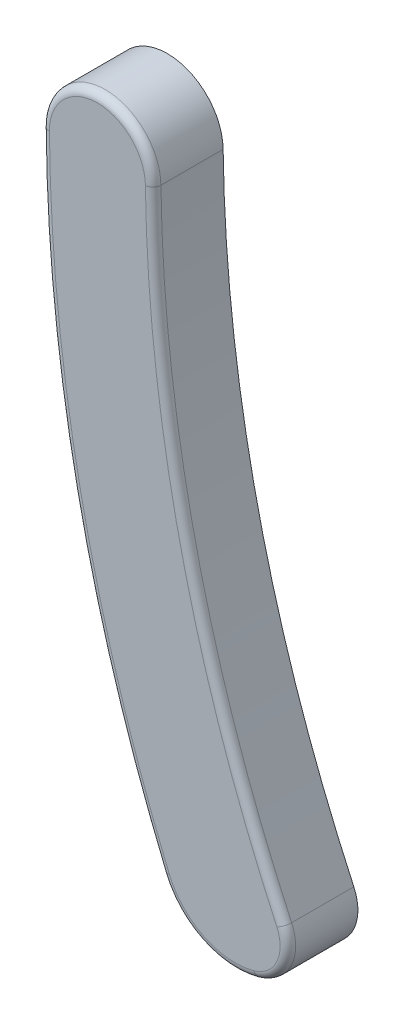
ISO-10303-21;
HEADER;
FILE_DESCRIPTION(('STEP AP214'),'2;1');
FILE_NAME('part.step','',(''),(''),'','','');
FILE_SCHEMA(('AUTOMOTIVE_DESIGN { 1 0 10303 214 1 1 1 1 }'));
ENDSEC;
DATA;
#1=APPLICATION_CONTEXT('core data for automotive mechanical design processes');
#2=APPLICATION_PROTOCOL_DEFINITION('international standard','automotive_design',2000,#1);
#3=PRODUCT_CONTEXT('',#1,'mechanical');
#4=PRODUCT('Part','Part','',(#3));
#5=PRODUCT_RELATED_PRODUCT_CATEGORY('part','',(#4));
#6=PRODUCT_DEFINITION_FORMATION('','',#4);
#7=PRODUCT_DEFINITION_CONTEXT('part definition',#1,'design');
#8=PRODUCT_DEFINITION('design','',#6,#7);
#9=PRODUCT_DEFINITION_SHAPE('','',#8);
#10=(LENGTH_UNIT() NAMED_UNIT(*) SI_UNIT(.MILLI.,.METRE.));
#11=(NAMED_UNIT(*) PLANE_ANGLE_UNIT() SI_UNIT($,.RADIAN.));
#12=(NAMED_UNIT(*) SI_UNIT($,.STERADIAN.) SOLID_ANGLE_UNIT());
#13=UNCERTAINTY_MEASURE_WITH_UNIT(LENGTH_MEASURE(1.E-05),#10,'distance_accuracy_value','');
#14=(GEOMETRIC_REPRESENTATION_CONTEXT(3) GLOBAL_UNCERTAINTY_ASSIGNED_CONTEXT((#13)) GLOBAL_UNIT_ASSIGNED_CONTEXT((#10,
#11,#12)) REPRESENTATION_CONTEXT('',''));
#15=CARTESIAN_POINT('',(0.,0.,0.));
#16=DIRECTION('',(0.,0.,1.));
#17=DIRECTION('',(1.,0.,0.));
#18=AXIS2_PLACEMENT_3D('',#15,#16,#17);
#19=CARTESIAN_POINT('',(-4.3325178151942,18.6432009402013,4.5));
#20=DIRECTION('',(0.,0.,-1.));
#21=DIRECTION('',(-1.,0.,0.));
#22=AXIS2_PLACEMENT_3D('',#19,#20,#21);
#23=CYLINDRICAL_SURFACE('',#22,3.58626907911739);
#24=DIRECTION('',(0.,0.,-1.));
#25=VECTOR('',#24,1.);
#26=CARTESIAN_POINT('',(-7.91866529262994,18.613668281761,4.5));
#27=LINE('',#26,#25);
#28=CARTESIAN_POINT('',(-7.91866529262994,18.613668281761,4.));
#29=VERTEX_POINT('',#28);
#30=CARTESIAN_POINT('',(-7.91866529262994,18.613668281761,0.));
#31=VERTEX_POINT('',#30);
#32=EDGE_CURVE('E100',#29,#31,#27,.T.);
#33=ORIENTED_EDGE('',*,*,#32,.F.);
#34=CARTESIAN_POINT('',(-4.3325178151942,18.6432009402013,4.));
#35=DIRECTION('',(0.,0.,1.));
#36=DIRECTION('',(1.,0.,0.));
#37=AXIS2_PLACEMENT_3D('',#34,#35,#36);
#38=CIRCLE('',#37,3.58626907911739);
#39=CARTESIAN_POINT('',(-0.746559935844632,18.6904449383862,4.));
#40=VERTEX_POINT('',#39);
#41=EDGE_CURVE('E48',#29,#40,#38,.F.);
#42=ORIENTED_EDGE('',*,*,#41,.T.);
#43=DIRECTION('',(0.,0.,-1.));
#44=VECTOR('',#43,1.);
#45=CARTESIAN_POINT('',(-0.746559935844632,18.6904449383862,4.5));
#46=LINE('',#45,#44);
#47=CARTESIAN_POINT('',(-0.746559935844632,18.6904449383862,0.));
#48=VERTEX_POINT('',#47);
#49=EDGE_CURVE('E119',#40,#48,#46,.T.);
#50=ORIENTED_EDGE('',*,*,#49,.T.);
#51=CARTESIAN_POINT('',(-4.3325178151942,18.6432009402013,0.));
#52=DIRECTION('',(0.,0.,1.));
#53=DIRECTION('',(1.,0.,0.));
#54=AXIS2_PLACEMENT_3D('',#51,#52,#53);
#55=CIRCLE('',#54,3.58626907911739);
#56=EDGE_CURVE('E114',#48,#31,#55,.T.);
#57=ORIENTED_EDGE('',*,*,#56,.T.);
#58=EDGE_LOOP('',(#33,#42,#50,#57));
#59=FACE_BOUND('',#58,.T.);
#60=ADVANCED_FACE('F39',(#59),#23,.T.);
#61=CARTESIAN_POINT('',(91.7779541223136,19.434690347185,4.5));
#62=DIRECTION('',(0.,0.,-1.));
#63=DIRECTION('',(-1.,0.,0.));
#64=AXIS2_PLACEMENT_3D('',#61,#62,#63);
#65=CYLINDRICAL_SURFACE('',#64,99.7);
#66=DIRECTION('',(0.,0.,-1.));
#67=VECTOR('',#66,1.);
#68=CARTESIAN_POINT('',(-0.170136467105035,-19.1092928014218,4.5));
#69=LINE('',#68,#67);
#70=CARTESIAN_POINT('',(-0.170136467105035,-19.1092928014218,4.));
#71=VERTEX_POINT('',#70);
#72=CARTESIAN_POINT('',(-0.170136467105035,-19.1092928014218,0.));
#73=VERTEX_POINT('',#72);
#74=EDGE_CURVE('E108',#71,#73,#69,.T.);
#75=ORIENTED_EDGE('',*,*,#74,.F.);
#76=CARTESIAN_POINT('',(91.7779541223136,19.434690347185,4.));
#77=DIRECTION('',(0.,0.,1.));
#78=DIRECTION('',(1.,0.,0.));
#79=AXIS2_PLACEMENT_3D('',#76,#77,#78);
#80=CIRCLE('',#79,99.7);
#81=EDGE_CURVE('E63',#71,#29,#80,.F.);
#82=ORIENTED_EDGE('',*,*,#81,.T.);
#83=ORIENTED_EDGE('',*,*,#32,.T.);
#84=CARTESIAN_POINT('',(91.7779541223136,19.434690347185,0.));
#85=DIRECTION('',(0.,0.,1.));
#86=DIRECTION('',(1.,0.,0.));
#87=AXIS2_PLACEMENT_3D('',#84,#85,#86);
#88=CIRCLE('',#87,99.7);
#89=EDGE_CURVE('E103',#31,#73,#88,.T.);
#90=ORIENTED_EDGE('',*,*,#89,.T.);
#91=EDGE_LOOP('',(#75,#82,#83,#90));
#92=FACE_BOUND('',#91,.T.);
#93=ADVANCED_FACE('F102',(#92),#65,.T.);
#94=CARTESIAN_POINT('',(4.5210509623076,-17.1427805218616,4.5));
#95=DIRECTION('',(0.,0.,-1.));
#96=DIRECTION('',(-1.,0.,0.));
#97=AXIS2_PLACEMENT_3D('',#94,#95,#96);
#98=CYLINDRICAL_SURFACE('',#97,5.08668949745705);
#99=DIRECTION('',(0.,0.,-1.));
#100=VECTOR('',#99,1.);
#101=CARTESIAN_POINT('',(5.86617411866489,-22.0483950335993,4.5));
#102=LINE('',#101,#100);
#103=CARTESIAN_POINT('',(5.86617411866489,-22.0483950335993,4.));
#104=VERTEX_POINT('',#103);
#105=CARTESIAN_POINT('',(5.86617411866489,-22.0483950335993,0.));
#106=VERTEX_POINT('',#105);
#107=EDGE_CURVE('E134',#104,#106,#102,.T.);
#108=ORIENTED_EDGE('',*,*,#107,.F.);
#109=CARTESIAN_POINT('',(4.5210509623076,-17.1427805218616,4.));
#110=DIRECTION('',(0.,0.,1.));
#111=DIRECTION('',(1.,0.,0.));
#112=AXIS2_PLACEMENT_3D('',#109,#110,#111);
#113=CIRCLE('',#112,5.08668949745705);
#114=EDGE_CURVE('E150',#104,#71,#113,.F.);
#115=ORIENTED_EDGE('',*,*,#114,.T.);
#116=ORIENTED_EDGE('',*,*,#74,.T.);
#117=CARTESIAN_POINT('',(4.5210509623076,-17.1427805218616,0.));
#118=DIRECTION('',(0.,0.,1.));
#119=DIRECTION('',(1.,0.,0.));
#120=AXIS2_PLACEMENT_3D('',#117,#118,#119);
#121=CIRCLE('',#120,5.08668949745705);
#122=EDGE_CURVE('E117',#73,#106,#121,.T.);
#123=ORIENTED_EDGE('',*,*,#122,.T.);
#124=EDGE_LOOP('',(#108,#115,#116,#123));
#125=FACE_BOUND('',#124,.T.);
#126=ADVANCED_FACE('F204',(#125),#98,.T.);
#127=CARTESIAN_POINT('',(5.1282433367813,-19.3571887041585,4.5));
#128=DIRECTION('',(0.,0.,-1.));
#129=DIRECTION('',(-1.,0.,0.));
#130=AXIS2_PLACEMENT_3D('',#127,#128,#129);
#131=CYLINDRICAL_SURFACE('',#130,2.79054355753018);
#132=DIRECTION('',(0.,0.,-1.));
#133=VECTOR('',#132,1.);
#134=CARTESIAN_POINT('',(7.65879384853875,-18.1809882731447,4.5));
#135=LINE('',#134,#133);
#136=CARTESIAN_POINT('',(7.65879384853875,-18.1809882731447,4.));
#137=VERTEX_POINT('',#136);
#138=CARTESIAN_POINT('',(7.65879384853875,-18.1809882731447,0.));
#139=VERTEX_POINT('',#138);
#140=EDGE_CURVE('E132',#137,#139,#135,.T.);
#141=ORIENTED_EDGE('',*,*,#140,.F.);
#142=CARTESIAN_POINT('',(5.1282433367813,-19.3571887041585,4.));
#143=DIRECTION('',(0.,0.,1.));
#144=DIRECTION('',(1.,0.,0.));
#145=AXIS2_PLACEMENT_3D('',#142,#143,#144);
#146=CIRCLE('',#145,2.79054355753018);
#147=EDGE_CURVE('E147',#137,#104,#146,.F.);
#148=ORIENTED_EDGE('',*,*,#147,.T.);
#149=ORIENTED_EDGE('',*,*,#107,.T.);
#150=CARTESIAN_POINT('',(5.1282433367813,-19.3571887041585,0.));
#151=DIRECTION('',(0.,0.,1.));
#152=DIRECTION('',(1.,0.,0.));
#153=AXIS2_PLACEMENT_3D('',#150,#151,#152);
#154=CIRCLE('',#153,2.79054355753018);
#155=EDGE_CURVE('E126',#106,#139,#154,.T.);
#156=ORIENTED_EDGE('',*,*,#155,.T.);
#157=EDGE_LOOP('',(#141,#148,#149,#156));
#158=FACE_BOUND('',#157,.T.);
#159=ADVANCED_FACE('F183',(#158),#131,.T.);
#160=CARTESIAN_POINT('',(89.5456042497148,19.8800191008309,4.5));
#161=DIRECTION('',(0.,0.,-1.));
#162=DIRECTION('',(-1.,0.,0.));
#163=AXIS2_PLACEMENT_3D('',#160,#161,#162);
#164=CYLINDRICAL_SURFACE('',#163,90.2999999999999);
#165=ORIENTED_EDGE('',*,*,#49,.F.);
#166=CARTESIAN_POINT('',(89.5456042497148,19.8800191008309,4.));
#167=DIRECTION('',(0.,0.,1.));
#168=DIRECTION('',(1.,0.,0.));
#169=AXIS2_PLACEMENT_3D('',#166,#167,#168);
#170=CIRCLE('',#169,90.2999999999999);
#171=EDGE_CURVE('E11',#40,#137,#170,.T.);
#172=ORIENTED_EDGE('',*,*,#171,.T.);
#173=ORIENTED_EDGE('',*,*,#140,.T.);
#174=CARTESIAN_POINT('',(89.5456042497148,19.8800191008309,0.));
#175=DIRECTION('',(0.,0.,-1.));
#176=DIRECTION('',(1.,0.,0.));
#177=AXIS2_PLACEMENT_3D('',#174,#175,#176);
#178=CIRCLE('',#177,90.2999999999999);
#179=EDGE_CURVE('E129',#139,#48,#178,.T.);
#180=ORIENTED_EDGE('',*,*,#179,.T.);
#181=EDGE_LOOP('',(#165,#172,#173,#180));
#182=FACE_BOUND('',#181,.T.);
#183=ADVANCED_FACE('F180',(#182),#164,.F.);
#184=CARTESIAN_POINT('',(43.7227181535597,19.0389456436931,4.5));
#185=DIRECTION('',(0.,0.,1.));
#186=DIRECTION('',(1.,0.,0.));
#187=AXIS2_PLACEMENT_3D('',#184,#185,#186);
#188=PLANE('',#187);
#189=CARTESIAN_POINT('',(4.5210509623076,-17.1427805218616,4.5));
#190=DIRECTION('',(0.,0.,1.));
#191=DIRECTION('',(1.,0.,0.));
#192=AXIS2_PLACEMENT_3D('',#189,#190,#191);
#193=CIRCLE('',#192,4.58668949745705);
#194=CARTESIAN_POINT('',(0.290987357315371,-18.9159929862332,4.5));
#195=VERTEX_POINT('',#194);
#196=CARTESIAN_POINT('',(5.73395421837123,-21.5661939365803,4.5));
#197=VERTEX_POINT('',#196);
#198=EDGE_CURVE('E142',#195,#197,#193,.T.);
#199=ORIENTED_EDGE('',*,*,#198,.T.);
#200=CARTESIAN_POINT('',(5.1282433367813,-19.3571887041585,4.5));
#201=DIRECTION('',(0.,0.,1.));
#202=DIRECTION('',(1.,0.,0.));
#203=AXIS2_PLACEMENT_3D('',#200,#201,#202);
#204=CIRCLE('',#203,2.29054355753018);
#205=CARTESIAN_POINT('',(7.20537850855438,-18.3917358222808,4.5));
#206=VERTEX_POINT('',#205);
#207=EDGE_CURVE('E144',#197,#206,#204,.T.);
#208=ORIENTED_EDGE('',*,*,#207,.T.);
#209=CARTESIAN_POINT('',(89.5456042497148,19.8800191008309,4.5));
#210=DIRECTION('',(0.,0.,1.));
#211=DIRECTION('',(1.,0.,0.));
#212=AXIS2_PLACEMENT_3D('',#209,#210,#211);
#213=CIRCLE('',#212,90.7999999999999);
#214=CARTESIAN_POINT('',(-1.24651654816778,18.6838581490039,4.5));
#215=VERTEX_POINT('',#214);
#216=EDGE_CURVE('E107',#206,#215,#213,.F.);
#217=ORIENTED_EDGE('',*,*,#216,.T.);
#218=CARTESIAN_POINT('',(-4.3325178151942,18.6432009402013,4.5));
#219=DIRECTION('',(0.,0.,1.));
#220=DIRECTION('',(1.,0.,0.));
#221=AXIS2_PLACEMENT_3D('',#218,#219,#220);
#222=CIRCLE('',#221,3.08626907911739);
#223=CARTESIAN_POINT('',(-7.4186822464166,18.6177857444762,4.5));
#224=VERTEX_POINT('',#223);
#225=EDGE_CURVE('E138',#215,#224,#222,.T.);
#226=ORIENTED_EDGE('',*,*,#225,.T.);
#227=CARTESIAN_POINT('',(91.7779541223136,19.434690347185,4.5));
#228=DIRECTION('',(0.,0.,1.));
#229=DIRECTION('',(1.,0.,0.));
#230=AXIS2_PLACEMENT_3D('',#227,#228,#229);
#231=CIRCLE('',#230,99.2);
#232=EDGE_CURVE('E140',#224,#195,#231,.T.);
#233=ORIENTED_EDGE('',*,*,#232,.T.);
#234=EDGE_LOOP('',(#199,#208,#217,#226,#233));
#235=FACE_BOUND('',#234,.T.);
#236=ADVANCED_FACE('F189',(#235),#188,.T.);
#237=CARTESIAN_POINT('',(43.7227181535597,19.0389456436931,0.));
#238=DIRECTION('',(0.,0.,1.));
#239=DIRECTION('',(1.,0.,0.));
#240=AXIS2_PLACEMENT_3D('',#237,#238,#239);
#241=PLANE('',#240);
#242=ORIENTED_EDGE('',*,*,#56,.F.);
#243=ORIENTED_EDGE('',*,*,#179,.F.);
#244=ORIENTED_EDGE('',*,*,#155,.F.);
#245=ORIENTED_EDGE('',*,*,#122,.F.);
#246=ORIENTED_EDGE('',*,*,#89,.F.);
#247=EDGE_LOOP('',(#242,#243,#244,#245,#246));
#248=FACE_BOUND('',#247,.T.);
#249=ADVANCED_FACE('F112',(#248),#241,.F.);
#250=CARTESIAN_POINT('',(91.7779541223136,19.434690347185,4.));
#251=DIRECTION('',(0.,0.,1.));
#252=DIRECTION('',(1.,0.,0.));
#253=AXIS2_PLACEMENT_3D('',#250,#251,#252);
#254=TOROIDAL_SURFACE('',#253,99.2,0.5);
#255=CARTESIAN_POINT('',(0.290987357315371,-18.9159929862332,4.));
#256=DIRECTION('',(0.386599630377137,-0.922247648840734,0.));
#257=DIRECTION('',(0.922247648840734,0.386599630377137,0.));
#258=AXIS2_PLACEMENT_3D('',#255,#256,#257);
#259=CIRCLE('',#258,0.5);
#260=EDGE_CURVE('E123',#195,#71,#259,.T.);
#261=ORIENTED_EDGE('',*,*,#260,.F.);
#262=ORIENTED_EDGE('',*,*,#232,.F.);
#263=CARTESIAN_POINT('',(-7.41868224641658,18.6177857444762,4.));
#264=DIRECTION('',(-0.00823492543053361,0.999966092426715,0.));
#265=DIRECTION('',(-0.999966092426715,-0.00823492543053361,0.));
#266=AXIS2_PLACEMENT_3D('',#263,#264,#265);
#267=CIRCLE('',#266,0.5);
#268=EDGE_CURVE('E43',#29,#224,#267,.T.);
#269=ORIENTED_EDGE('',*,*,#268,.F.);
#270=ORIENTED_EDGE('',*,*,#81,.F.);
#271=EDGE_LOOP('',(#261,#262,#269,#270));
#272=FACE_BOUND('',#271,.T.);
#273=ADVANCED_FACE('F41',(#272),#254,.T.);
#274=CARTESIAN_POINT('',(-4.3325178151942,18.6432009402013,4.));
#275=DIRECTION('',(0.,0.,1.));
#276=DIRECTION('',(1.,0.,0.));
#277=AXIS2_PLACEMENT_3D('',#274,#275,#276);
#278=TOROIDAL_SURFACE('',#277,3.08626907911739,0.5);
#279=ORIENTED_EDGE('',*,*,#268,.T.);
#280=ORIENTED_EDGE('',*,*,#225,.F.);
#281=CARTESIAN_POINT('',(-1.24651654816781,18.6838581490039,4.));
#282=DIRECTION('',(0.0131735787646317,-0.999913224646285,0.));
#283=DIRECTION('',(0.999913224646285,0.0131735787646317,0.));
#284=AXIS2_PLACEMENT_3D('',#281,#282,#283);
#285=CIRCLE('',#284,0.5);
#286=EDGE_CURVE('E158',#40,#215,#285,.T.);
#287=ORIENTED_EDGE('',*,*,#286,.F.);
#288=ORIENTED_EDGE('',*,*,#41,.F.);
#289=EDGE_LOOP('',(#279,#280,#287,#288));
#290=FACE_BOUND('',#289,.T.);
#291=ADVANCED_FACE('F172',(#290),#278,.T.);
#292=CARTESIAN_POINT('',(4.5210509623076,-17.1427805218616,4.));
#293=DIRECTION('',(0.,0.,1.));
#294=DIRECTION('',(1.,0.,0.));
#295=AXIS2_PLACEMENT_3D('',#292,#293,#294);
#296=TOROIDAL_SURFACE('',#295,4.58668949745705,0.5);
#297=ORIENTED_EDGE('',*,*,#260,.T.);
#298=ORIENTED_EDGE('',*,*,#114,.F.);
#299=CARTESIAN_POINT('',(5.73395421837123,-21.5661939365803,4.));
#300=DIRECTION('',(0.964402194038008,0.264439800587348,0.));
#301=DIRECTION('',(-0.264439800587348,0.964402194038008,0.));
#302=AXIS2_PLACEMENT_3D('',#299,#300,#301);
#303=CIRCLE('',#302,0.5);
#304=EDGE_CURVE('E156',#197,#104,#303,.T.);
#305=ORIENTED_EDGE('',*,*,#304,.F.);
#306=ORIENTED_EDGE('',*,*,#198,.F.);
#307=EDGE_LOOP('',(#297,#298,#305,#306));
#308=FACE_BOUND('',#307,.T.);
#309=ADVANCED_FACE('F165',(#308),#296,.T.);
#310=CARTESIAN_POINT('',(89.5456042497148,19.8800191008309,4.));
#311=DIRECTION('',(0.,0.,1.));
#312=DIRECTION('',(1.,0.,0.));
#313=AXIS2_PLACEMENT_3D('',#310,#311,#312);
#314=TOROIDAL_SURFACE('',#313,90.7999999999999,0.5);
#315=ORIENTED_EDGE('',*,*,#286,.T.);
#316=ORIENTED_EDGE('',*,*,#216,.F.);
#317=CARTESIAN_POINT('',(7.20537850855439,-18.3917358222808,4.));
#318=DIRECTION('',(0.421495098272155,-0.906830679968728,0.));
#319=DIRECTION('',(0.906830679968728,0.421495098272155,0.));
#320=AXIS2_PLACEMENT_3D('',#317,#318,#319);
#321=CIRCLE('',#320,0.5);
#322=EDGE_CURVE('E154',#137,#206,#321,.T.);
#323=ORIENTED_EDGE('',*,*,#322,.F.);
#324=ORIENTED_EDGE('',*,*,#171,.F.);
#325=EDGE_LOOP('',(#315,#316,#323,#324));
#326=FACE_BOUND('',#325,.T.);
#327=ADVANCED_FACE('F177',(#326),#314,.T.);
#328=CARTESIAN_POINT('',(5.1282433367813,-19.3571887041585,4.));
#329=DIRECTION('',(0.,0.,1.));
#330=DIRECTION('',(1.,0.,0.));
#331=AXIS2_PLACEMENT_3D('',#328,#329,#330);
#332=TOROIDAL_SURFACE('',#331,2.29054355753018,0.5);
#333=ORIENTED_EDGE('',*,*,#304,.T.);
#334=ORIENTED_EDGE('',*,*,#147,.F.);
#335=ORIENTED_EDGE('',*,*,#322,.T.);
#336=ORIENTED_EDGE('',*,*,#207,.F.);
#337=EDGE_LOOP('',(#333,#334,#335,#336));
#338=FACE_BOUND('',#337,.T.);
#339=ADVANCED_FACE('F186',(#338),#332,.T.);
#340=CLOSED_SHELL('',(#60,#93,#126,#159,#183,#236,#249,#273,#291,#309,#327,#339));
#341=MANIFOLD_SOLID_BREP('B2',#340);
#342=ADVANCED_BREP_SHAPE_REPRESENTATION('',(#18,#341),#14);
#343=SHAPE_DEFINITION_REPRESENTATION(#9,#342);
ENDSEC;
END-ISO-10303-21;
